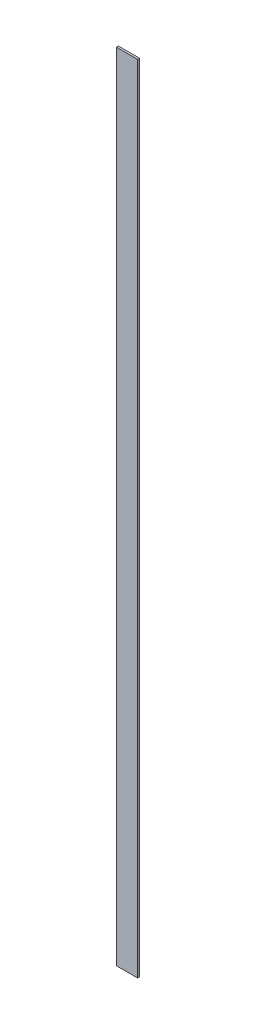
ISO-10303-21;
HEADER;
FILE_DESCRIPTION(('STEP AP214'),'2;1');
FILE_NAME('part.step','',(''),(''),'','','');
FILE_SCHEMA(('AUTOMOTIVE_DESIGN { 1 0 10303 214 1 1 1 1 }'));
ENDSEC;
DATA;
#1=APPLICATION_CONTEXT('core data for automotive mechanical design processes');
#2=APPLICATION_PROTOCOL_DEFINITION('international standard','automotive_design',2000,#1);
#3=PRODUCT_CONTEXT('',#1,'mechanical');
#4=PRODUCT('Part','Part','',(#3));
#5=PRODUCT_RELATED_PRODUCT_CATEGORY('part','',(#4));
#6=PRODUCT_DEFINITION_FORMATION('','',#4);
#7=PRODUCT_DEFINITION_CONTEXT('part definition',#1,'design');
#8=PRODUCT_DEFINITION('design','',#6,#7);
#9=PRODUCT_DEFINITION_SHAPE('','',#8);
#10=(LENGTH_UNIT() NAMED_UNIT(*) SI_UNIT(.MILLI.,.METRE.));
#11=(NAMED_UNIT(*) PLANE_ANGLE_UNIT() SI_UNIT($,.RADIAN.));
#12=(NAMED_UNIT(*) SI_UNIT($,.STERADIAN.) SOLID_ANGLE_UNIT());
#13=UNCERTAINTY_MEASURE_WITH_UNIT(LENGTH_MEASURE(1.E-05),#10,'distance_accuracy_value','');
#14=(GEOMETRIC_REPRESENTATION_CONTEXT(3) GLOBAL_UNCERTAINTY_ASSIGNED_CONTEXT((#13)) GLOBAL_UNIT_ASSIGNED_CONTEXT((#10,
#11,#12)) REPRESENTATION_CONTEXT('',''));
#15=CARTESIAN_POINT('',(0.,0.,0.));
#16=DIRECTION('',(0.,0.,1.));
#17=DIRECTION('',(1.,0.,0.));
#18=AXIS2_PLACEMENT_3D('',#15,#16,#17);
#19=CARTESIAN_POINT('',(0.,0.,0.75));
#20=DIRECTION('',(0.,0.,-1.));
#21=DIRECTION('',(-1.,0.,0.));
#22=AXIS2_PLACEMENT_3D('',#19,#20,#21);
#23=PLANE('',#22);
#24=DIRECTION('',(1.,0.,0.));
#25=VECTOR('',#24,1.);
#26=CARTESIAN_POINT('',(160.313158045854,160.929115844304,0.75));
#27=LINE('',#26,#25);
#28=CARTESIAN_POINT('',(160.313158045854,160.929115844304,0.75));
#29=VERTEX_POINT('',#28);
#30=CARTESIAN_POINT('',(152.313158045854,160.929115844304,0.75));
#31=VERTEX_POINT('',#30);
#32=EDGE_CURVE('E80',#29,#31,#27,.F.);
#33=ORIENTED_EDGE('',*,*,#32,.T.);
#34=DIRECTION('',(0.,1.,0.));
#35=VECTOR('',#34,1.);
#36=CARTESIAN_POINT('',(152.313158045854,160.929115844304,0.75));
#37=LINE('',#36,#35);
#38=CARTESIAN_POINT('',(152.313158045854,-139.070884155696,0.75));
#39=VERTEX_POINT('',#38);
#40=EDGE_CURVE('E55',#31,#39,#37,.F.);
#41=ORIENTED_EDGE('',*,*,#40,.T.);
#42=DIRECTION('',(1.,0.,0.));
#43=VECTOR('',#42,1.);
#44=CARTESIAN_POINT('',(160.313158045854,-139.070884155696,0.75));
#45=LINE('',#44,#43);
#46=CARTESIAN_POINT('',(160.313158045854,-139.070884155696,0.75));
#47=VERTEX_POINT('',#46);
#48=EDGE_CURVE('E57',#39,#47,#45,.T.);
#49=ORIENTED_EDGE('',*,*,#48,.T.);
#50=DIRECTION('',(0.,-1.,0.));
#51=VECTOR('',#50,1.);
#52=CARTESIAN_POINT('',(160.313158045854,160.929115844304,0.75));
#53=LINE('',#52,#51);
#54=EDGE_CURVE('E20',#47,#29,#53,.F.);
#55=ORIENTED_EDGE('',*,*,#54,.T.);
#56=EDGE_LOOP('',(#33,#41,#49,#55));
#57=FACE_BOUND('',#56,.T.);
#58=ADVANCED_FACE('F17',(#57),#23,.F.);
#59=CARTESIAN_POINT('',(160.313158045854,160.929115844304,0.75));
#60=DIRECTION('',(-1.,0.,0.));
#61=DIRECTION('',(0.,-1.,0.));
#62=AXIS2_PLACEMENT_3D('',#59,#60,#61);
#63=PLANE('',#62);
#64=DIRECTION('',(0.,0.,-1.));
#65=VECTOR('',#64,1.);
#66=CARTESIAN_POINT('',(160.313158045854,160.929115844304,0.75));
#67=LINE('',#66,#65);
#68=CARTESIAN_POINT('',(160.313158045854,160.929115844304,0.));
#69=VERTEX_POINT('',#68);
#70=EDGE_CURVE('E68',#69,#29,#67,.F.);
#71=ORIENTED_EDGE('',*,*,#70,.T.);
#72=ORIENTED_EDGE('',*,*,#54,.F.);
#73=DIRECTION('',(0.,0.,1.));
#74=VECTOR('',#73,1.);
#75=CARTESIAN_POINT('',(160.313158045854,-139.070884155696,0.75));
#76=LINE('',#75,#74);
#77=CARTESIAN_POINT('',(160.313158045854,-139.070884155696,0.));
#78=VERTEX_POINT('',#77);
#79=EDGE_CURVE('E63',#47,#78,#76,.F.);
#80=ORIENTED_EDGE('',*,*,#79,.T.);
#81=DIRECTION('',(0.,1.,0.));
#82=VECTOR('',#81,1.);
#83=CARTESIAN_POINT('',(160.313158045854,0.,0.));
#84=LINE('',#83,#82);
#85=EDGE_CURVE('E83',#69,#78,#84,.F.);
#86=ORIENTED_EDGE('',*,*,#85,.F.);
#87=EDGE_LOOP('',(#71,#72,#80,#86));
#88=FACE_BOUND('',#87,.T.);
#89=ADVANCED_FACE('F65',(#88),#63,.F.);
#90=CARTESIAN_POINT('',(160.313158045854,-139.070884155696,0.75));
#91=DIRECTION('',(0.,1.,0.));
#92=DIRECTION('',(0.,0.,1.));
#93=AXIS2_PLACEMENT_3D('',#90,#91,#92);
#94=PLANE('',#93);
#95=ORIENTED_EDGE('',*,*,#79,.F.);
#96=ORIENTED_EDGE('',*,*,#48,.F.);
#97=DIRECTION('',(0.,0.,1.));
#98=VECTOR('',#97,1.);
#99=CARTESIAN_POINT('',(152.313158045854,-139.070884155696,0.75));
#100=LINE('',#99,#98);
#101=CARTESIAN_POINT('',(152.313158045854,-139.070884155696,0.));
#102=VERTEX_POINT('',#101);
#103=EDGE_CURVE('E75',#39,#102,#100,.F.);
#104=ORIENTED_EDGE('',*,*,#103,.T.);
#105=DIRECTION('',(-1.,0.,0.));
#106=VECTOR('',#105,1.);
#107=CARTESIAN_POINT('',(0.,-139.070884155696,0.));
#108=LINE('',#107,#106);
#109=EDGE_CURVE('E72',#78,#102,#108,.T.);
#110=ORIENTED_EDGE('',*,*,#109,.F.);
#111=EDGE_LOOP('',(#95,#96,#104,#110));
#112=FACE_BOUND('',#111,.T.);
#113=ADVANCED_FACE('F70',(#112),#94,.F.);
#114=CARTESIAN_POINT('',(152.313158045854,160.929115844304,0.75));
#115=DIRECTION('',(1.,0.,0.));
#116=DIRECTION('',(0.,1.,0.));
#117=AXIS2_PLACEMENT_3D('',#114,#115,#116);
#118=PLANE('',#117);
#119=ORIENTED_EDGE('',*,*,#103,.F.);
#120=ORIENTED_EDGE('',*,*,#40,.F.);
#121=DIRECTION('',(0.,0.,-1.));
#122=VECTOR('',#121,1.);
#123=CARTESIAN_POINT('',(152.313158045854,160.929115844304,0.75));
#124=LINE('',#123,#122);
#125=CARTESIAN_POINT('',(152.313158045854,160.929115844304,0.));
#126=VERTEX_POINT('',#125);
#127=EDGE_CURVE('E35',#31,#126,#124,.T.);
#128=ORIENTED_EDGE('',*,*,#127,.T.);
#129=DIRECTION('',(0.,1.,0.));
#130=VECTOR('',#129,1.);
#131=CARTESIAN_POINT('',(152.313158045854,0.,0.));
#132=LINE('',#131,#130);
#133=EDGE_CURVE('E26',#102,#126,#132,.T.);
#134=ORIENTED_EDGE('',*,*,#133,.F.);
#135=EDGE_LOOP('',(#119,#120,#128,#134));
#136=FACE_BOUND('',#135,.T.);
#137=ADVANCED_FACE('F89',(#136),#118,.F.);
#138=CARTESIAN_POINT('',(160.313158045854,160.929115844304,0.75));
#139=DIRECTION('',(0.,-1.,0.));
#140=DIRECTION('',(0.,0.,-1.));
#141=AXIS2_PLACEMENT_3D('',#138,#139,#140);
#142=PLANE('',#141);
#143=ORIENTED_EDGE('',*,*,#127,.F.);
#144=ORIENTED_EDGE('',*,*,#32,.F.);
#145=ORIENTED_EDGE('',*,*,#70,.F.);
#146=DIRECTION('',(-1.,0.,0.));
#147=VECTOR('',#146,1.);
#148=CARTESIAN_POINT('',(0.,160.929115844304,0.));
#149=LINE('',#148,#147);
#150=EDGE_CURVE('E11',#126,#69,#149,.F.);
#151=ORIENTED_EDGE('',*,*,#150,.F.);
#152=EDGE_LOOP('',(#143,#144,#145,#151));
#153=FACE_BOUND('',#152,.T.);
#154=ADVANCED_FACE('F91',(#153),#142,.F.);
#155=CARTESIAN_POINT('',(0.,0.,0.));
#156=DIRECTION('',(0.,0.,-1.));
#157=DIRECTION('',(-1.,0.,0.));
#158=AXIS2_PLACEMENT_3D('',#155,#156,#157);
#159=PLANE('',#158);
#160=ORIENTED_EDGE('',*,*,#133,.T.);
#161=ORIENTED_EDGE('',*,*,#150,.T.);
#162=ORIENTED_EDGE('',*,*,#85,.T.);
#163=ORIENTED_EDGE('',*,*,#109,.T.);
#164=EDGE_LOOP('',(#160,#161,#162,#163));
#165=FACE_BOUND('',#164,.T.);
#166=ADVANCED_FACE('F88',(#165),#159,.T.);
#167=CLOSED_SHELL('',(#58,#89,#113,#137,#154,#166));
#168=MANIFOLD_SOLID_BREP('B1',#167);
#169=ADVANCED_BREP_SHAPE_REPRESENTATION('',(#18,#168),#14);
#170=SHAPE_DEFINITION_REPRESENTATION(#9,#169);
ENDSEC;
END-ISO-10303-21;
